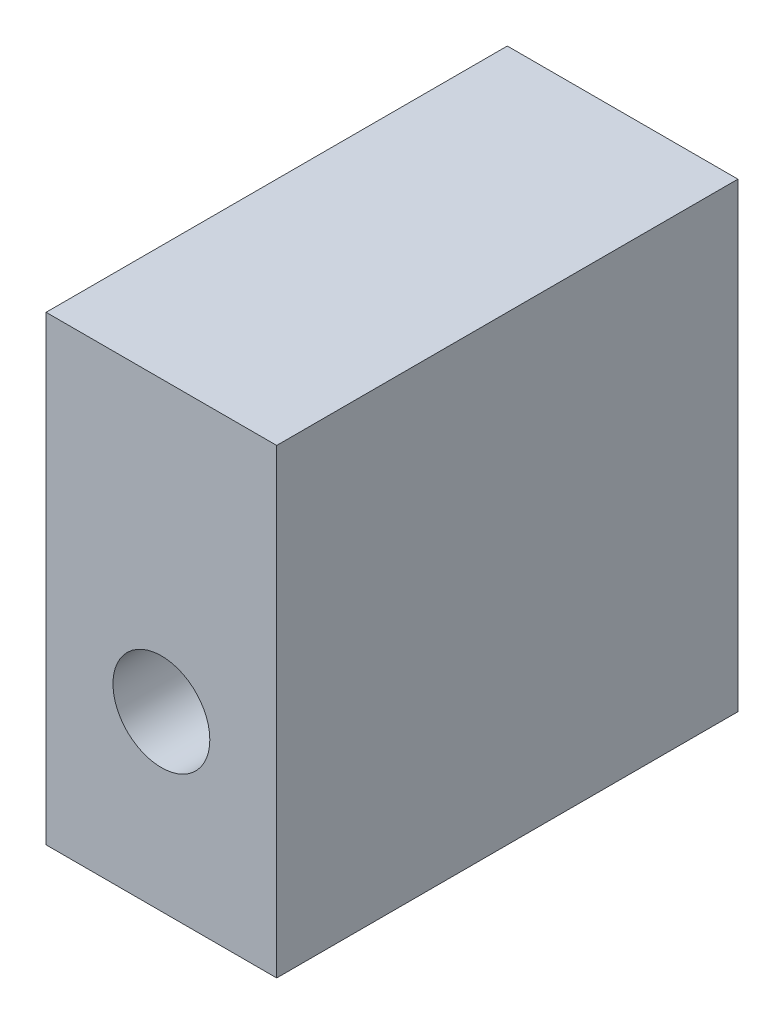
ISO-10303-21;
HEADER;
FILE_DESCRIPTION(('STEP AP214'),'2;1');
FILE_NAME('part.step','',(''),(''),'','','');
FILE_SCHEMA(('AUTOMOTIVE_DESIGN { 1 0 10303 214 1 1 1 1 }'));
ENDSEC;
DATA;
#1=APPLICATION_CONTEXT('core data for automotive mechanical design processes');
#2=APPLICATION_PROTOCOL_DEFINITION('international standard','automotive_design',2000,#1);
#3=PRODUCT_CONTEXT('',#1,'mechanical');
#4=PRODUCT('Part','Part','',(#3));
#5=PRODUCT_RELATED_PRODUCT_CATEGORY('part','',(#4));
#6=PRODUCT_DEFINITION_FORMATION('','',#4);
#7=PRODUCT_DEFINITION_CONTEXT('part definition',#1,'design');
#8=PRODUCT_DEFINITION('design','',#6,#7);
#9=PRODUCT_DEFINITION_SHAPE('','',#8);
#10=(LENGTH_UNIT() NAMED_UNIT(*) SI_UNIT(.MILLI.,.METRE.));
#11=(NAMED_UNIT(*) PLANE_ANGLE_UNIT() SI_UNIT($,.RADIAN.));
#12=(NAMED_UNIT(*) SI_UNIT($,.STERADIAN.) SOLID_ANGLE_UNIT());
#13=UNCERTAINTY_MEASURE_WITH_UNIT(LENGTH_MEASURE(1.E-05),#10,'distance_accuracy_value','');
#14=(GEOMETRIC_REPRESENTATION_CONTEXT(3) GLOBAL_UNCERTAINTY_ASSIGNED_CONTEXT((#13)) GLOBAL_UNIT_ASSIGNED_CONTEXT((#10,
#11,#12)) REPRESENTATION_CONTEXT('',''));
#15=CARTESIAN_POINT('',(0.,0.,0.));
#16=DIRECTION('',(0.,0.,1.));
#17=DIRECTION('',(1.,0.,0.));
#18=AXIS2_PLACEMENT_3D('',#15,#16,#17);
#19=CARTESIAN_POINT('',(25.4,101.6,50.8));
#20=DIRECTION('',(-1.,0.,0.));
#21=DIRECTION('',(0.,0.,1.));
#22=AXIS2_PLACEMENT_3D('',#19,#20,#21);
#23=PLANE('',#22);
#24=DIRECTION('',(0.,0.,-1.));
#25=VECTOR('',#24,1.);
#26=CARTESIAN_POINT('',(25.4,0.,50.8));
#27=LINE('',#26,#25);
#28=CARTESIAN_POINT('',(25.4,0.,50.8));
#29=VERTEX_POINT('',#28);
#30=CARTESIAN_POINT('',(25.4,0.,-50.8));
#31=VERTEX_POINT('',#30);
#32=EDGE_CURVE('E96',#29,#31,#27,.T.);
#33=ORIENTED_EDGE('',*,*,#32,.T.);
#34=DIRECTION('',(0.,-1.,0.));
#35=VECTOR('',#34,1.);
#36=CARTESIAN_POINT('',(25.4,101.6,-50.8));
#37=LINE('',#36,#35);
#38=CARTESIAN_POINT('',(25.4,101.6,-50.8));
#39=VERTEX_POINT('',#38);
#40=EDGE_CURVE('E11',#39,#31,#37,.T.);
#41=ORIENTED_EDGE('',*,*,#40,.F.);
#42=DIRECTION('',(0.,0.,-1.));
#43=VECTOR('',#42,1.);
#44=CARTESIAN_POINT('',(25.4,101.6,50.8));
#45=LINE('',#44,#43);
#46=CARTESIAN_POINT('',(25.4,101.6,50.8));
#47=VERTEX_POINT('',#46);
#48=EDGE_CURVE('E84',#47,#39,#45,.T.);
#49=ORIENTED_EDGE('',*,*,#48,.F.);
#50=DIRECTION('',(0.,-1.,0.));
#51=VECTOR('',#50,1.);
#52=CARTESIAN_POINT('',(25.4,101.6,50.8));
#53=LINE('',#52,#51);
#54=EDGE_CURVE('E92',#47,#29,#53,.T.);
#55=ORIENTED_EDGE('',*,*,#54,.T.);
#56=EDGE_LOOP('',(#33,#41,#49,#55));
#57=FACE_BOUND('',#56,.T.);
#58=ADVANCED_FACE('F33',(#57),#23,.F.);
#59=CARTESIAN_POINT('',(-25.4,101.6,-50.8));
#60=DIRECTION('',(0.,0.,1.));
#61=DIRECTION('',(1.,0.,0.));
#62=AXIS2_PLACEMENT_3D('',#59,#60,#61);
#63=PLANE('',#62);
#64=CARTESIAN_POINT('',(0.,38.1,-50.8));
#65=DIRECTION('',(0.,0.,1.));
#66=DIRECTION('',(1.,0.,0.));
#67=AXIS2_PLACEMENT_3D('',#64,#65,#66);
#68=CIRCLE('',#67,10.668);
#69=CARTESIAN_POINT('',(10.668,38.1,-50.8));
#70=VERTEX_POINT('',#69);
#71=EDGE_CURVE('E99',#70,#70,#68,.T.);
#72=ORIENTED_EDGE('',*,*,#71,.T.);
#73=EDGE_LOOP('',(#72));
#74=FACE_BOUND('',#73,.T.);
#75=DIRECTION('',(-1.,0.,0.));
#76=VECTOR('',#75,1.);
#77=CARTESIAN_POINT('',(-25.4,0.,-50.8));
#78=LINE('',#77,#76);
#79=CARTESIAN_POINT('',(-25.4,0.,-50.8));
#80=VERTEX_POINT('',#79);
#81=EDGE_CURVE('E88',#31,#80,#78,.T.);
#82=ORIENTED_EDGE('',*,*,#81,.T.);
#83=DIRECTION('',(0.,-1.,0.));
#84=VECTOR('',#83,1.);
#85=CARTESIAN_POINT('',(-25.4,101.6,-50.8));
#86=LINE('',#85,#84);
#87=CARTESIAN_POINT('',(-25.4,101.6,-50.8));
#88=VERTEX_POINT('',#87);
#89=EDGE_CURVE('E41',#88,#80,#86,.T.);
#90=ORIENTED_EDGE('',*,*,#89,.F.);
#91=DIRECTION('',(-1.,0.,0.));
#92=VECTOR('',#91,1.);
#93=CARTESIAN_POINT('',(-25.4,101.6,-50.8));
#94=LINE('',#93,#92);
#95=EDGE_CURVE('E79',#39,#88,#94,.T.);
#96=ORIENTED_EDGE('',*,*,#95,.F.);
#97=ORIENTED_EDGE('',*,*,#40,.T.);
#98=EDGE_LOOP('',(#82,#90,#96,#97));
#99=FACE_BOUND('',#98,.T.);
#100=ADVANCED_FACE('F87',(#74,#99),#63,.F.);
#101=CARTESIAN_POINT('',(-25.4,101.6,50.8));
#102=DIRECTION('',(1.,0.,0.));
#103=DIRECTION('',(0.,0.,-1.));
#104=AXIS2_PLACEMENT_3D('',#101,#102,#103);
#105=PLANE('',#104);
#106=DIRECTION('',(0.,0.,1.));
#107=VECTOR('',#106,1.);
#108=CARTESIAN_POINT('',(-25.4,0.,50.8));
#109=LINE('',#108,#107);
#110=CARTESIAN_POINT('',(-25.4,0.,50.8));
#111=VERTEX_POINT('',#110);
#112=EDGE_CURVE('E66',#80,#111,#109,.T.);
#113=ORIENTED_EDGE('',*,*,#112,.T.);
#114=DIRECTION('',(0.,-1.,0.));
#115=VECTOR('',#114,1.);
#116=CARTESIAN_POINT('',(-25.4,101.6,50.8));
#117=LINE('',#116,#115);
#118=CARTESIAN_POINT('',(-25.4,101.6,50.8));
#119=VERTEX_POINT('',#118);
#120=EDGE_CURVE('E89',#119,#111,#117,.T.);
#121=ORIENTED_EDGE('',*,*,#120,.F.);
#122=DIRECTION('',(0.,0.,1.));
#123=VECTOR('',#122,1.);
#124=CARTESIAN_POINT('',(-25.4,101.6,50.8));
#125=LINE('',#124,#123);
#126=EDGE_CURVE('E82',#88,#119,#125,.T.);
#127=ORIENTED_EDGE('',*,*,#126,.F.);
#128=ORIENTED_EDGE('',*,*,#89,.T.);
#129=EDGE_LOOP('',(#113,#121,#127,#128));
#130=FACE_BOUND('',#129,.T.);
#131=ADVANCED_FACE('F90',(#130),#105,.F.);
#132=CARTESIAN_POINT('',(-25.4,101.6,50.8));
#133=DIRECTION('',(0.,0.,-1.));
#134=DIRECTION('',(-1.,0.,0.));
#135=AXIS2_PLACEMENT_3D('',#132,#133,#134);
#136=PLANE('',#135);
#137=CARTESIAN_POINT('',(0.,38.1,50.8));
#138=DIRECTION('',(0.,0.,1.));
#139=DIRECTION('',(1.,0.,0.));
#140=AXIS2_PLACEMENT_3D('',#137,#138,#139);
#141=CIRCLE('',#140,10.668);
#142=CARTESIAN_POINT('',(10.668,38.1,50.8));
#143=VERTEX_POINT('',#142);
#144=EDGE_CURVE('E112',#143,#143,#141,.T.);
#145=ORIENTED_EDGE('',*,*,#144,.F.);
#146=EDGE_LOOP('',(#145));
#147=FACE_BOUND('',#146,.T.);
#148=DIRECTION('',(1.,0.,0.));
#149=VECTOR('',#148,1.);
#150=CARTESIAN_POINT('',(-25.4,0.,50.8));
#151=LINE('',#150,#149);
#152=EDGE_CURVE('E72',#111,#29,#151,.T.);
#153=ORIENTED_EDGE('',*,*,#152,.T.);
#154=ORIENTED_EDGE('',*,*,#54,.F.);
#155=DIRECTION('',(1.,0.,0.));
#156=VECTOR('',#155,1.);
#157=CARTESIAN_POINT('',(-25.4,101.6,50.8));
#158=LINE('',#157,#156);
#159=EDGE_CURVE('E49',#119,#47,#158,.T.);
#160=ORIENTED_EDGE('',*,*,#159,.F.);
#161=ORIENTED_EDGE('',*,*,#120,.T.);
#162=EDGE_LOOP('',(#153,#154,#160,#161));
#163=FACE_BOUND('',#162,.T.);
#164=ADVANCED_FACE('F104',(#147,#163),#136,.F.);
#165=CARTESIAN_POINT('',(0.,101.6,0.));
#166=DIRECTION('',(0.,-1.,0.));
#167=DIRECTION('',(0.,0.,-1.));
#168=AXIS2_PLACEMENT_3D('',#165,#166,#167);
#169=PLANE('',#168);
#170=ORIENTED_EDGE('',*,*,#48,.T.);
#171=ORIENTED_EDGE('',*,*,#95,.T.);
#172=ORIENTED_EDGE('',*,*,#126,.T.);
#173=ORIENTED_EDGE('',*,*,#159,.T.);
#174=EDGE_LOOP('',(#170,#171,#172,#173));
#175=FACE_BOUND('',#174,.T.);
#176=ADVANCED_FACE('F80',(#175),#169,.F.);
#177=CARTESIAN_POINT('',(0.,0.,0.));
#178=DIRECTION('',(0.,-1.,0.));
#179=DIRECTION('',(0.,0.,-1.));
#180=AXIS2_PLACEMENT_3D('',#177,#178,#179);
#181=PLANE('',#180);
#182=ORIENTED_EDGE('',*,*,#32,.F.);
#183=ORIENTED_EDGE('',*,*,#152,.F.);
#184=ORIENTED_EDGE('',*,*,#112,.F.);
#185=ORIENTED_EDGE('',*,*,#81,.F.);
#186=EDGE_LOOP('',(#182,#183,#184,#185));
#187=FACE_BOUND('',#186,.T.);
#188=ADVANCED_FACE('F107',(#187),#181,.T.);
#189=CARTESIAN_POINT('',(0.,38.1,-50.8));
#190=DIRECTION('',(0.,0.,1.));
#191=DIRECTION('',(1.,0.,0.));
#192=AXIS2_PLACEMENT_3D('',#189,#190,#191);
#193=CYLINDRICAL_SURFACE('',#192,10.668);
#194=ORIENTED_EDGE('',*,*,#71,.F.);
#195=EDGE_LOOP('',(#194));
#196=FACE_BOUND('',#195,.T.);
#197=ORIENTED_EDGE('',*,*,#144,.T.);
#198=EDGE_LOOP('',(#197));
#199=FACE_BOUND('',#198,.T.);
#200=ADVANCED_FACE('F116',(#196,#199),#193,.F.);
#201=CLOSED_SHELL('',(#58,#100,#131,#164,#176,#188,#200));
#202=MANIFOLD_SOLID_BREP('B2',#201);
#203=ADVANCED_BREP_SHAPE_REPRESENTATION('',(#18,#202),#14);
#204=SHAPE_DEFINITION_REPRESENTATION(#9,#203);
ENDSEC;
END-ISO-10303-21;
